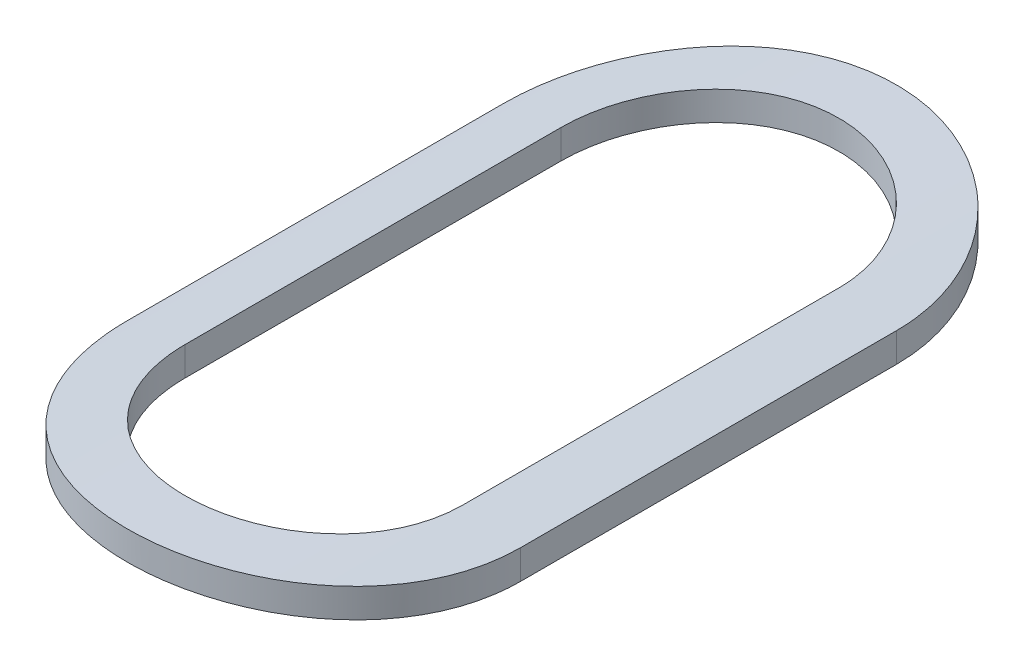
ISO-10303-21;
HEADER;
FILE_DESCRIPTION(('STEP AP214'),'2;1');
FILE_NAME('part.step','',(''),(''),'','','');
FILE_SCHEMA(('AUTOMOTIVE_DESIGN { 1 0 10303 214 1 1 1 1 }'));
ENDSEC;
DATA;
#1=APPLICATION_CONTEXT('core data for automotive mechanical design processes');
#2=APPLICATION_PROTOCOL_DEFINITION('international standard','automotive_design',2000,#1);
#3=PRODUCT_CONTEXT('',#1,'mechanical');
#4=PRODUCT('Part','Part','',(#3));
#5=PRODUCT_RELATED_PRODUCT_CATEGORY('part','',(#4));
#6=PRODUCT_DEFINITION_FORMATION('','',#4);
#7=PRODUCT_DEFINITION_CONTEXT('part definition',#1,'design');
#8=PRODUCT_DEFINITION('design','',#6,#7);
#9=PRODUCT_DEFINITION_SHAPE('','',#8);
#10=(LENGTH_UNIT() NAMED_UNIT(*) SI_UNIT(.MILLI.,.METRE.));
#11=(NAMED_UNIT(*) PLANE_ANGLE_UNIT() SI_UNIT($,.RADIAN.));
#12=(NAMED_UNIT(*) SI_UNIT($,.STERADIAN.) SOLID_ANGLE_UNIT());
#13=UNCERTAINTY_MEASURE_WITH_UNIT(LENGTH_MEASURE(1.E-05),#10,'distance_accuracy_value','');
#14=(GEOMETRIC_REPRESENTATION_CONTEXT(3) GLOBAL_UNCERTAINTY_ASSIGNED_CONTEXT((#13)) GLOBAL_UNIT_ASSIGNED_CONTEXT((#10,
#11,#12)) REPRESENTATION_CONTEXT('',''));
#15=CARTESIAN_POINT('',(0.,0.,0.));
#16=DIRECTION('',(0.,0.,1.));
#17=DIRECTION('',(1.,0.,0.));
#18=AXIS2_PLACEMENT_3D('',#15,#16,#17);
#19=CARTESIAN_POINT('',(-205.237767720161,-97.4477839792411,1.93657000024674));
#20=DIRECTION('',(0.,0.,1.));
#21=DIRECTION('',(1.,0.,0.));
#22=AXIS2_PLACEMENT_3D('',#19,#20,#21);
#23=CYLINDRICAL_SURFACE('',#22,5.00000000000003);
#24=CARTESIAN_POINT('',(-205.816025312001,-92.4813347287726,5.59072481894899));
#25=CARTESIAN_POINT('',(-205.81605345322,-92.4813470455981,5.55830863861098));
#26=CARTESIAN_POINT('',(-205.813301256707,-92.4810176953498,5.52590317346151));
#27=CARTESIAN_POINT('',(-205.802446677341,-92.4797671542148,5.46204489278413));
#28=CARTESIAN_POINT('',(-205.794349708049,-92.4788465622047,5.43059114696678));
#29=CARTESIAN_POINT('',(-205.773011592033,-92.4765042816047,5.36948772147703));
#30=CARTESIAN_POINT('',(-205.759768660538,-92.4750824191753,5.33983867185818));
#31=CARTESIAN_POINT('',(-205.728529674045,-92.4719021558279,5.28318577848136));
#32=CARTESIAN_POINT('',(-205.710534070537,-92.4701437868815,5.25618168379419));
#33=CARTESIAN_POINT('',(-205.670207756246,-92.4664783744416,5.20545632084834));
#34=CARTESIAN_POINT('',(-205.647859171863,-92.4645707380577,5.18174930304975));
#35=CARTESIAN_POINT('',(-205.599497501548,-92.460827112354,5.13841097931241));
#36=CARTESIAN_POINT('',(-205.573483858366,-92.4589911339836,5.11878029427919));
#37=CARTESIAN_POINT('',(-205.518441967116,-92.4555917582716,5.08410392899681));
#38=CARTESIAN_POINT('',(-205.489405485113,-92.4540291382538,5.06907123573406));
#39=CARTESIAN_POINT('',(-205.429200909222,-92.4513592357457,5.04410151892306));
#40=CARTESIAN_POINT('',(-205.398033010825,-92.4502519115612,5.03416402875613));
#41=CARTESIAN_POINT('',(-205.334596648131,-92.4486214638352,5.0197085814315));
#42=CARTESIAN_POINT('',(-205.302333729771,-92.4480957495245,5.01516658343613));
#43=CARTESIAN_POINT('',(-205.237498790808,-92.4476789168199,5.01155656965439));
#44=CARTESIAN_POINT('',(-205.204926773204,-92.4477877922755,5.01248850081497));
#45=CARTESIAN_POINT('',(-205.140563410856,-92.4486257894006,5.01978072308774));
#46=CARTESIAN_POINT('',(-205.108769075323,-92.4493519393145,5.02611500604303));
#47=CARTESIAN_POINT('',(-205.046697948224,-92.4513395212461,5.04399149063643));
#48=CARTESIAN_POINT('',(-205.016421173954,-92.4526009593627,5.05553375161367));
#49=CARTESIAN_POINT('',(-204.958162773233,-92.4555225006161,5.08352681484934));
#50=CARTESIAN_POINT('',(-204.930186698027,-92.4571835321094,5.0999890694036));
#51=CARTESIAN_POINT('',(-204.87738579882,-92.4607180906581,5.13734570534176));
#52=CARTESIAN_POINT('',(-204.852560962508,-92.4625916168832,5.15824006940841));
#53=CARTESIAN_POINT('',(-204.806616299284,-92.4663540775476,5.20401073591256));
#54=CARTESIAN_POINT('',(-204.785518493568,-92.4682430387985,5.22890914671363));
#55=CARTESIAN_POINT('',(-204.747792196947,-92.4718132541877,5.28191400103796));
#56=CARTESIAN_POINT('',(-204.731165046413,-92.473494445952,5.31002140307583));
#57=CARTESIAN_POINT('',(-204.702849827051,-92.4764596597479,5.36867354385038));
#58=CARTESIAN_POINT('',(-204.691166312109,-92.4777433152941,5.39922049915794));
#59=CARTESIAN_POINT('',(-204.67312304922,-92.479759834021,5.46182387993567));
#60=CARTESIAN_POINT('',(-204.666755270332,-92.4804935279044,5.4938779507941));
#61=CARTESIAN_POINT('',(-204.660710580302,-92.4811955947182,5.54764353747746));
#62=CARTESIAN_POINT('',(-204.659499727931,-92.4813388156744,5.56918928601582));
#63=CARTESIAN_POINT('',(-204.659510128705,-92.4813347287279,5.59072481894899));
#64=B_SPLINE_CURVE_WITH_KNOTS('',3,(#24,#25,#26,#27,#28,#29,#30,#31,#32,#33,#34,#35,#36,#37,#38,
#39,#40,#41,#42,#43,#44,#45,#46,#47,#48,#49,#50,#51,#52,#53,#54,#55,#56,#57,#58,#59,#60,#61,#62,
#63),.UNSPECIFIED.,.F.,.F.,(4,2,2,2,2,2,2,2,2,2,2,2,2,2,2,2,2,2,2,4),(0.,0.0971144596016317,
0.194130705508772,0.291180629617419,0.388221337577798,0.485669235955006,0.58313196669033,
0.680867490696586,0.778594062484605,0.87588353827593,0.973172071143981,1.0699948615776,
1.16681875522746,1.26386980537719,1.36092047633352,1.45852667401611,1.55616210298787,
1.65388727516014,1.75146453691093,1.81606442695371),.UNSPECIFIED.);
#65=CARTESIAN_POINT('',(-205.816025312001,-92.4813347287725,5.59072481894899));
#66=VERTEX_POINT('',#65);
#67=CARTESIAN_POINT('',(-204.659510128705,-92.4813347287279,5.59072481894899));
#68=VERTEX_POINT('',#67);
#69=EDGE_CURVE('E173',#66,#68,#64,.T.);
#70=ORIENTED_EDGE('',*,*,#69,.T.);
#71=DIRECTION('',(0.,0.,1.));
#72=VECTOR('',#71,1.);
#73=CARTESIAN_POINT('',(-204.659510128705,-92.4813347287279,5.59072481894899));
#74=LINE('',#73,#72);
#75=CARTESIAN_POINT('',(-204.659510128705,-92.4813347287279,7.15573389731877));
#76=VERTEX_POINT('',#75);
#77=EDGE_CURVE('E111',#76,#68,#74,.F.);
#78=ORIENTED_EDGE('',*,*,#77,.F.);
#79=CARTESIAN_POINT('',(-204.659510128705,-92.4813347287279,7.15573389731877));
#80=CARTESIAN_POINT('',(-204.65948198318,-92.4813470453749,7.18814998051298));
#81=CARTESIAN_POINT('',(-204.66223416535,-92.4810176971892,7.22055534875823));
#82=CARTESIAN_POINT('',(-204.673088717127,-92.4797671597198,7.28441363488721));
#83=CARTESIAN_POINT('',(-204.681185705116,-92.4788465657793,7.31586747756815));
#84=CARTESIAN_POINT('',(-204.702524070631,-92.4765042566045,7.376971643256));
#85=CARTESIAN_POINT('',(-204.715767326654,-92.4750823584012,7.40662130312217));
#86=CARTESIAN_POINT('',(-204.747006549714,-92.4719020810574,7.4632740903792));
#87=CARTESIAN_POINT('',(-204.765001863621,-92.4701437481661,7.49027758076557));
#88=CARTESIAN_POINT('',(-204.805325364428,-92.4664785790867,7.54099954981871));
#89=CARTESIAN_POINT('',(-204.827671036202,-92.4645711628689,7.56470408707736));
#90=CARTESIAN_POINT('',(-204.876032349208,-92.4608275253215,7.60804336459656));
#91=CARTESIAN_POINT('',(-204.902049364491,-92.4589913309773,7.62767657428111));
#92=CARTESIAN_POINT('',(-204.957107529511,-92.4555908299197,7.66236409441228));
#93=CARTESIAN_POINT('',(-204.986158174165,-92.4540274204009,7.67740341282563));
#94=CARTESIAN_POINT('',(-205.046371666948,-92.4513580548523,7.70236837040192));
#95=CARTESIAN_POINT('',(-205.077531998354,-92.4502515645608,7.712299985203));
#96=CARTESIAN_POINT('',(-205.130346152671,-92.4488934431359,7.72433731075692));
#97=CARTESIAN_POINT('',(-205.151664012772,-92.4484793797971,7.72795250716278));
#98=CARTESIAN_POINT('',(-205.194574057236,-92.4479245041211,7.73278007816721));
#99=CARTESIAN_POINT('',(-205.216166245618,-92.4477836957932,7.73399241750974));
#100=CARTESIAN_POINT('',(-205.270132833281,-92.4477844039261,7.73399009774741));
#101=CARTESIAN_POINT('',(-205.302518792684,-92.448101558574,7.73126510134122));
#102=CARTESIAN_POINT('',(-205.36639046982,-92.449336246177,7.72043685244457));
#103=CARTESIAN_POINT('',(-205.397875198236,-92.4502544143552,7.71232790942491));
#104=CARTESIAN_POINT('',(-205.459010687186,-92.4525875978119,7.69097284333577));
#105=CARTESIAN_POINT('',(-205.488662624789,-92.4540022902267,7.67773005795223));
#106=CARTESIAN_POINT('',(-205.545317635545,-92.4571708752444,7.64648980535055));
#107=CARTESIAN_POINT('',(-205.572321144898,-92.4589247118479,7.62849312291705));
#108=CARTESIAN_POINT('',(-205.623045523049,-92.4625847434808,7.58816547581902));
#109=CARTESIAN_POINT('',(-205.646752120136,-92.4644915478026,7.56581661476488));
#110=CARTESIAN_POINT('',(-205.690087991771,-92.4682377457699,7.51745532118685));
#111=CARTESIAN_POINT('',(-205.709716908808,-92.4700771334931,7.49144256776678));
#112=CARTESIAN_POINT('',(-205.744395340358,-92.4734866329095,7.43639752630437));
#113=CARTESIAN_POINT('',(-205.759430426865,-92.4750558895899,7.40735610141012));
#114=CARTESIAN_POINT('',(-205.784398136002,-92.4777383200303,7.34714349325492));
#115=CARTESIAN_POINT('',(-205.794333600315,-92.4788517477236,7.31597350709657));
#116=CARTESIAN_POINT('',(-205.806375173798,-92.4802182866102,7.26313576380745));
#117=CARTESIAN_POINT('',(-205.809991257807,-92.4806348583557,7.24180410654383));
#118=CARTESIAN_POINT('',(-205.81481628588,-92.4811939415349,7.19889604255411));
#119=CARTESIAN_POINT('',(-205.816028473882,-92.4813368222921,7.17732000522887));
#120=CARTESIAN_POINT('',(-205.816025312001,-92.4813347287726,7.15573389731877));
#121=B_SPLINE_CURVE_WITH_KNOTS('',3,(#79,#80,#81,#82,#83,#84,#85,#86,#87,#88,#89,#90,#91,#92,
#93,#94,#95,#96,#97,#98,#99,#100,#101,#102,#103,#104,#105,#106,#107,#108,#109,#110,#111,#112,
#113,#114,#115,#116,#117,#118,#119,#120),.UNSPECIFIED.,.F.,.F.,(4,2,2,2,2,2,2,2,2,2,2,2,2,2,2,2,
2,2,2,2,4),(0.,0.0971141698559982,0.194130705514868,0.291182687565261,0.388221337553569,
0.485658369900073,0.583131966607676,0.680920348294414,0.778594063001648,0.843344867671633,
0.908096622394172,1.00511304740935,1.10223217692015,1.19928827157682,1.29632835398478,
1.3937762336066,1.49123265335904,1.5889920840456,1.68669698057032,1.75148885975864,
1.81619324588166),.UNSPECIFIED.);
#122=CARTESIAN_POINT('',(-205.816025312001,-92.4813347287725,7.15573389731877));
#123=VERTEX_POINT('',#122);
#124=EDGE_CURVE('E118',#76,#123,#121,.T.);
#125=ORIENTED_EDGE('',*,*,#124,.T.);
#126=DIRECTION('',(0.,0.,-1.));
#127=VECTOR('',#126,1.);
#128=CARTESIAN_POINT('',(-205.816025312001,-92.4813347287725,7.15573389731877));
#129=LINE('',#128,#127);
#130=EDGE_CURVE('E115',#66,#123,#129,.F.);
#131=ORIENTED_EDGE('',*,*,#130,.F.);
#132=EDGE_LOOP('',(#70,#78,#125,#131));
#133=FACE_BOUND('',#132,.T.);
#134=DIRECTION('',(0.,0.,1.));
#135=VECTOR('',#134,1.);
#136=CARTESIAN_POINT('',(-206.056025312001,-92.5151929244914,5.5907247421057));
#137=LINE('',#136,#135);
#138=CARTESIAN_POINT('',(-206.056025312001,-92.5151929244914,7.15573404952093));
#139=VERTEX_POINT('',#138);
#140=CARTESIAN_POINT('',(-206.056025312001,-92.5151929244914,5.59072479973817));
#141=VERTEX_POINT('',#140);
#142=EDGE_CURVE('E98',#139,#141,#137,.F.);
#143=ORIENTED_EDGE('',*,*,#142,.F.);
#144=CARTESIAN_POINT('',(-204.419510128705,-92.5151929244278,7.15573393574041));
#145=CARTESIAN_POINT('',(-204.419469583894,-92.5152177455033,7.20144062728406));
#146=CARTESIAN_POINT('',(-204.423337202401,-92.514558298794,7.24712861852095));
#147=CARTESIAN_POINT('',(-204.438581215502,-92.5120563218705,7.33714331646355));
#148=CARTESIAN_POINT('',(-204.449947946265,-92.5102153143735,7.38147169841267));
#149=CARTESIAN_POINT('',(-204.479887760545,-92.505534208199,7.46757797875938));
#150=CARTESIAN_POINT('',(-204.498462619333,-92.5026938634135,7.50935524591362));
#151=CARTESIAN_POINT('',(-204.542264858439,-92.496343081097,7.58920088857968));
#152=CARTESIAN_POINT('',(-204.567492006978,-92.4928326669135,7.62726939324835));
#153=CARTESIAN_POINT('',(-204.624135409762,-92.4854987717767,7.69897043503352));
#154=CARTESIAN_POINT('',(-204.65560135479,-92.481672931592,7.73256347916432));
#155=CARTESIAN_POINT('',(-204.723733811126,-92.4741593685713,7.7940285489356));
#156=CARTESIAN_POINT('',(-204.760402239161,-92.4704716972759,7.82189845672336));
#157=CARTESIAN_POINT('',(-204.838163315761,-92.4636242885595,7.87127330484976));
#158=CARTESIAN_POINT('',(-204.87928180731,-92.4604679404276,7.8927380112084));
#159=CARTESIAN_POINT('',(-204.964570477406,-92.4550711398516,7.92841794469071));
#160=CARTESIAN_POINT('',(-205.008736994849,-92.4528296102206,7.94264170284925));
#161=CARTESIAN_POINT('',(-205.083910694341,-92.4500602914303,7.95999259391576));
#162=CARTESIAN_POINT('',(-205.114434780676,-92.4492108397193,7.96523433098877));
#163=CARTESIAN_POINT('',(-205.175890775964,-92.4480724009212,7.97223446118956));
#164=CARTESIAN_POINT('',(-205.206822688049,-92.4477834181408,7.97399282755124));
#165=CARTESIAN_POINT('',(-205.283398607863,-92.4477848066276,7.97398951511892));
#166=CARTESIAN_POINT('',(-205.329058023749,-92.448415213171,7.97016126957229));
#167=CARTESIAN_POINT('',(-205.419099966746,-92.450869588219,7.95495422428733));
#168=CARTESIAN_POINT('',(-205.463481130311,-92.4526947853451,7.94356765203653));
#169=CARTESIAN_POINT('',(-205.549646007249,-92.4573338703443,7.91359646311223));
#170=CARTESIAN_POINT('',(-205.591431903344,-92.4601469137761,7.89501799290937));
#171=CARTESIAN_POINT('',(-205.671287461548,-92.4664521176568,7.85120532604741));
#172=CARTESIAN_POINT('',(-205.709357582195,-92.4699441941514,7.82597195205024));
#173=CARTESIAN_POINT('',(-205.781057576196,-92.4772560952725,7.76931874459996));
#174=CARTESIAN_POINT('',(-205.814648260083,-92.481078384344,7.73784962869663));
#175=CARTESIAN_POINT('',(-205.876098923618,-92.4886011796767,7.66972142970277));
#176=CARTESIAN_POINT('',(-205.903958316683,-92.4923016734399,7.63306181602657));
#177=CARTESIAN_POINT('',(-205.953315865383,-92.4991864135317,7.55532107308957));
#178=CARTESIAN_POINT('',(-205.974773689082,-92.5023673318523,7.51421404533556));
#179=CARTESIAN_POINT('',(-206.010454954267,-92.5078161409318,7.42892485239091));
#180=CARTESIAN_POINT('',(-206.024682761172,-92.510084582463,7.38474456117462));
#181=CARTESIAN_POINT('',(-206.042035603347,-92.5128875242913,7.30954355458309));
#182=CARTESIAN_POINT('',(-206.047276741209,-92.5137474123375,7.27900648206287));
#183=CARTESIAN_POINT('',(-206.054272095082,-92.5149020576824,7.21756231142058));
#184=CARTESIAN_POINT('',(-206.056030475274,-92.5151974898613,7.18665569969813));
#185=CARTESIAN_POINT('',(-206.056025312001,-92.5151929244915,7.15573404952093));
#186=B_SPLINE_CURVE_WITH_KNOTS('',3,(#144,#145,#146,#147,#148,#149,#150,#151,#152,#153,#154,
#155,#156,#157,#158,#159,#160,#161,#162,#163,#164,#165,#166,#167,#168,#169,#170,#171,#172,#173,
#174,#175,#176,#177,#178,#179,#180,#181,#182,#183,#184,#185),.UNSPECIFIED.,.F.,.F.,(4,2,2,2,2,2,
2,2,2,2,2,2,2,2,2,2,2,2,2,2,4),(0.,0.136923950960331,0.273671796791194,0.410453343293104,
0.547230124703325,0.685143554436099,0.823107927577552,0.96192150806652,1.10057116248184,
1.19332857538334,1.28608670102634,1.42286586335768,1.55978589921435,1.69658917540754,
1.83337554825507,1.97128949854094,2.10921755692805,2.24799709478118,2.38669273896364,
2.47948852703616,2.57217329610049),.UNSPECIFIED.);
#187=CARTESIAN_POINT('',(-204.419510128705,-92.5151929244278,7.15573391652959));
#188=VERTEX_POINT('',#187);
#189=EDGE_CURVE('E21',#188,#139,#186,.T.);
#190=ORIENTED_EDGE('',*,*,#189,.F.);
#191=DIRECTION('',(0.,0.,-1.));
#192=VECTOR('',#191,1.);
#193=CARTESIAN_POINT('',(-204.419510128705,-92.5151929244278,7.15573397416205));
#194=LINE('',#193,#192);
#195=CARTESIAN_POINT('',(-204.419510128705,-92.5151929244278,5.59072463315072));
#196=VERTEX_POINT('',#195);
#197=EDGE_CURVE('E85',#196,#188,#194,.F.);
#198=ORIENTED_EDGE('',*,*,#197,.F.);
#199=CARTESIAN_POINT('',(-206.056025312001,-92.5151929244915,5.59072478052735));
#200=CARTESIAN_POINT('',(-206.056065850808,-92.515217745583,5.54501798086097));
#201=CARTESIAN_POINT('',(-206.052198216996,-92.5145582957453,5.49932988171258));
#202=CARTESIAN_POINT('',(-206.036954174544,-92.5120563133006,5.40931518981686));
#203=CARTESIAN_POINT('',(-206.025587465142,-92.5102153089893,5.36498691568371));
#204=CARTESIAN_POINT('',(-205.995647976741,-92.505534255493,5.27888160837736));
#205=CARTESIAN_POINT('',(-205.977073551117,-92.502693978035,5.23710516070275));
#206=CARTESIAN_POINT('',(-205.933271629356,-92.4963432223219,5.15725937641797));
#207=CARTESIAN_POINT('',(-205.908044096061,-92.4928327403238,5.11919006051434));
#208=CARTESIAN_POINT('',(-205.851396862148,-92.485498374046,5.04748437182457));
#209=CARTESIAN_POINT('',(-205.819926933647,-92.4816721051632,5.01388791642143));
#210=CARTESIAN_POINT('',(-205.751793995122,-92.4741585643196,4.95242414862027));
#211=CARTESIAN_POINT('',(-205.715130190961,-92.4704713137239,4.92455771393512));
#212=CARTESIAN_POINT('',(-205.637391631918,-92.463626125481,4.87519843513922));
#213=CARTESIAN_POINT('',(-205.596292805583,-92.4604713419292,4.85374302744877));
#214=CARTESIAN_POINT('',(-205.511016664348,-92.4550734914938,4.81805647838143));
#215=CARTESIAN_POINT('',(-205.466839718733,-92.4528303154637,4.80382447209881));
#216=CARTESIAN_POINT('',(-205.377075908382,-92.4495251357669,4.7831101446398));
#217=CARTESIAN_POINT('',(-205.331505067711,-92.4484528095476,4.77656005871528));
#218=CARTESIAN_POINT('',(-205.239898318281,-92.4475746926404,4.77118480712422));
#219=CARTESIAN_POINT('',(-205.193862429081,-92.4477688489088,4.7723593179304));
#220=CARTESIAN_POINT('',(-205.103097894796,-92.4493936818346,4.78234723644037));
#221=CARTESIAN_POINT('',(-205.058360960137,-92.4508125204654,4.79108751421577));
#222=CARTESIAN_POINT('',(-204.970997657123,-92.4547140846072,4.81584372512715));
#223=CARTESIAN_POINT('',(-204.928371337958,-92.4571968349013,4.83185982774976));
#224=CARTESIAN_POINT('',(-204.84622004591,-92.4629674986844,4.87078643699166));
#225=CARTESIAN_POINT('',(-204.806709726253,-92.4662589478132,4.89372732231488));
#226=CARTESIAN_POINT('',(-204.732073401851,-92.4732809318163,4.94582923116358));
#227=CARTESIAN_POINT('',(-204.696947574812,-92.4770114844759,4.97499050667523));
#228=CARTESIAN_POINT('',(-204.631648055881,-92.484547753114,5.03910687284073));
#229=CARTESIAN_POINT('',(-204.60153640729,-92.4883538392547,5.07412513420221));
#230=CARTESIAN_POINT('',(-204.547597917773,-92.4955714661168,5.1487620250887));
#231=CARTESIAN_POINT('',(-204.523772874036,-92.4989828938587,5.18838196547077));
#232=CARTESIAN_POINT('',(-204.483072318769,-92.5050255837505,5.27117369756667));
#233=CARTESIAN_POINT('',(-204.46620814016,-92.5076555717108,5.3143511452217));
#234=CARTESIAN_POINT('',(-204.440013102122,-92.5118173602202,5.40294883090291));
#235=CARTESIAN_POINT('',(-204.430670974507,-92.5133508030295,5.44836560564371));
#236=CARTESIAN_POINT('',(-204.4233185101,-92.5145624854378,5.51022600836041));
#237=CARTESIAN_POINT('',(-204.421889767019,-92.5147986920222,5.52630589035521));
#238=CARTESIAN_POINT('',(-204.419986824293,-92.5151137500438,5.55849638745254));
#239=CARTESIAN_POINT('',(-204.419511019327,-92.515192866114,5.57460690502848));
#240=CARTESIAN_POINT('',(-204.419510128705,-92.5151929244277,5.59072463315072));
#241=B_SPLINE_CURVE_WITH_KNOTS('',3,(#199,#200,#201,#202,#203,#204,#205,#206,#207,#208,#209,
#210,#211,#212,#213,#214,#215,#216,#217,#218,#219,#220,#221,#222,#223,#224,#225,#226,#227,#228,
#229,#230,#231,#232,#233,#234,#235,#236,#237,#238,#239,#240),.UNSPECIFIED.,.F.,.F.,(4,2,2,2,2,2,
2,2,2,2,2,2,2,2,2,2,2,2,2,2,4),(0.,0.136924273568553,0.273671796779466,0.410450578793854,
0.547230124755246,0.685158470322033,0.823107927758298,0.961847852289611,1.10057116064877,
1.23806131441292,1.37554570974907,1.5117158488138,1.64788916005503,1.78466876048583,
1.92145390287004,2.05982271657086,2.19823104382085,2.33686383193083,2.47528855687437,
2.52370175778949,2.57203333292965),.UNSPECIFIED.);
#242=EDGE_CURVE('E99',#141,#196,#241,.T.);
#243=ORIENTED_EDGE('',*,*,#242,.F.);
#244=EDGE_LOOP('',(#143,#190,#198,#243));
#245=FACE_BOUND('',#244,.T.);
#246=ADVANCED_FACE('F17',(#133,#245),#23,.T.);
#247=CARTESIAN_POINT('',(-206.056025312001,-90.5682667595488,5.5907247421057));
#248=DIRECTION('',(-1.,0.,0.));
#249=DIRECTION('',(0.,0.,1.));
#250=AXIS2_PLACEMENT_3D('',#247,#248,#249);
#251=PLANE('',#250);
#252=ORIENTED_EDGE('',*,*,#142,.T.);
#253=DIRECTION('',(0.,1.,0.));
#254=VECTOR('',#253,1.);
#255=CARTESIAN_POINT('',(-206.056025312001,-90.5682667595488,5.59072478052734));
#256=LINE('',#255,#254);
#257=CARTESIAN_POINT('',(-206.056025312001,-92.6368740327345,5.59072479973817));
#258=VERTEX_POINT('',#257);
#259=EDGE_CURVE('E168',#258,#141,#256,.T.);
#260=ORIENTED_EDGE('',*,*,#259,.F.);
#261=DIRECTION('',(0.,0.,1.));
#262=VECTOR('',#261,1.);
#263=CARTESIAN_POINT('',(-206.056025312001,-92.6368740327345,1.93657000024674));
#264=LINE('',#263,#262);
#265=CARTESIAN_POINT('',(-206.056025312001,-92.6368740327345,7.15573404952093));
#266=VERTEX_POINT('',#265);
#267=EDGE_CURVE('E106',#258,#266,#264,.T.);
#268=ORIENTED_EDGE('',*,*,#267,.T.);
#269=DIRECTION('',(0.,1.,0.));
#270=VECTOR('',#269,1.);
#271=CARTESIAN_POINT('',(-206.056025312001,-90.5682667595488,7.15573404952093));
#272=LINE('',#271,#270);
#273=EDGE_CURVE('E93',#139,#266,#272,.F.);
#274=ORIENTED_EDGE('',*,*,#273,.F.);
#275=EDGE_LOOP('',(#252,#260,#268,#274));
#276=FACE_BOUND('',#275,.T.);
#277=ADVANCED_FACE('F105',(#276),#251,.T.);
#278=CARTESIAN_POINT('',(-205.237767720353,-90.5682667595488,7.15573389731877));
#279=DIRECTION('',(0.,1.,0.));
#280=DIRECTION('',(0.,0.,1.));
#281=AXIS2_PLACEMENT_3D('',#278,#279,#280);
#282=CYLINDRICAL_SURFACE('',#281,0.818257591648157);
#283=DIRECTION('',(0.,1.,0.));
#284=VECTOR('',#283,1.);
#285=CARTESIAN_POINT('',(-204.419510128705,-90.5682667595488,7.15573393574041));
#286=LINE('',#285,#284);
#287=CARTESIAN_POINT('',(-204.419510128705,-92.6368740326692,7.15573391652959));
#288=VERTEX_POINT('',#287);
#289=EDGE_CURVE('E95',#188,#288,#286,.F.);
#290=ORIENTED_EDGE('',*,*,#289,.F.);
#291=ORIENTED_EDGE('',*,*,#189,.T.);
#292=ORIENTED_EDGE('',*,*,#273,.T.);
#293=CARTESIAN_POINT('',(-206.056025312001,-92.6368740327345,7.15573404952093));
#294=CARTESIAN_POINT('',(-206.056065921352,-92.6368994793883,7.20142445889431));
#295=CARTESIAN_POINT('',(-206.052200966113,-92.6362238161791,7.24709581319684));
#296=CARTESIAN_POINT('',(-206.036968439681,-92.6336605145276,7.3370758927431));
#297=CARTESIAN_POINT('',(-206.025610733758,-92.6317744698129,7.38138632965162));
#298=CARTESIAN_POINT('',(-205.995696237809,-92.6269791620225,7.46745686640818));
#299=CARTESIAN_POINT('',(-205.977137759895,-92.6240696590593,7.50921636564857));
#300=CARTESIAN_POINT('',(-205.933375508098,-92.6175644569927,7.58903003851365));
#301=CARTESIAN_POINT('',(-205.908171898375,-92.613968774841,7.62708430363948));
#302=CARTESIAN_POINT('',(-205.851569911574,-92.6064550500433,7.69877794601749));
#303=CARTESIAN_POINT('',(-205.820119377924,-92.6025344673586,7.73237588363824));
#304=CARTESIAN_POINT('',(-205.752017050511,-92.5948343659367,7.79385452933834));
#305=CARTESIAN_POINT('',(-205.715363342521,-92.5910548997649,7.82173312402348));
#306=CARTESIAN_POINT('',(-205.637617200762,-92.5840351827162,7.87113690487236));
#307=CARTESIAN_POINT('',(-205.59649765922,-92.5807985674395,7.89261994686493));
#308=CARTESIAN_POINT('',(-205.511200595883,-92.5752637467863,7.92833522100554));
#309=CARTESIAN_POINT('',(-205.467026745235,-92.5729644369773,7.94257599169339));
#310=CARTESIAN_POINT('',(-205.39180925086,-92.5701219000218,7.95995868886599));
#311=CARTESIAN_POINT('',(-205.361249460828,-92.569249467263,7.96521307832648));
#312=CARTESIAN_POINT('',(-205.299720061526,-92.5680802177776,7.97223016093575));
#313=CARTESIAN_POINT('',(-205.26875044941,-92.5677834050525,7.97399282981159));
#314=CARTESIAN_POINT('',(-205.192153355237,-92.567784824591,7.97398951490654));
#315=CARTESIAN_POINT('',(-205.146510558836,-92.5684302632369,7.97016400730152));
#316=CARTESIAN_POINT('',(-205.056502147742,-92.5709431824667,7.95496834703232));
#317=CARTESIAN_POINT('',(-205.012137892963,-92.5728119175024,7.94359044946237));
#318=CARTESIAN_POINT('',(-204.926007053466,-92.5775617659709,7.91364362909559));
#319=CARTESIAN_POINT('',(-204.88423823572,-92.580441994546,7.89508099008717));
#320=CARTESIAN_POINT('',(-204.804413714789,-92.5868982541706,7.8513071221693));
#321=CARTESIAN_POINT('',(-204.766357568201,-92.5904742019774,7.82609668853926));
#322=CARTESIAN_POINT('',(-204.694665515389,-92.5979641700168,7.7694843316278));
#323=CARTESIAN_POINT('',(-204.661070638303,-92.6018808441097,7.73803079878828));
#324=CARTESIAN_POINT('',(-204.59960769215,-92.609590759877,7.66993330081925));
#325=CARTESIAN_POINT('',(-204.571740218754,-92.6133839886781,7.63328879647803));
#326=CARTESIAN_POINT('',(-204.522354353636,-92.6204438996072,7.55556327437977));
#327=CARTESIAN_POINT('',(-204.500878322293,-92.6237070063014,7.51445501830231));
#328=CARTESIAN_POINT('',(-204.465162052465,-92.6292977740442,7.42915721751077));
#329=CARTESIAN_POINT('',(-204.450917412383,-92.6316260039523,7.38496956583603));
#330=CARTESIAN_POINT('',(-204.433533272905,-92.6345047311212,7.30972546597324));
#331=CARTESIAN_POINT('',(-204.428279714226,-92.6353884213789,7.27915346398208));
#332=CARTESIAN_POINT('',(-204.421267581236,-92.636575088953,7.21763700566062));
#333=CARTESIAN_POINT('',(-204.41950488892,-92.6368787504859,7.18669303155297));
#334=CARTESIAN_POINT('',(-204.419510128705,-92.6368740326692,7.15573393574041));
#335=B_SPLINE_CURVE_WITH_KNOTS('',3,(#293,#294,#295,#296,#297,#298,#299,#300,#301,#302,#303,
#304,#305,#306,#307,#308,#309,#310,#311,#312,#313,#314,#315,#316,#317,#318,#319,#320,#321,#322,
#323,#324,#325,#326,#327,#328,#329,#330,#331,#332,#333,#334),.UNSPECIFIED.,.F.,.F.,(4,2,2,2,2,2,
2,2,2,2,2,2,2,2,2,2,2,2,2,2,4),(0.,0.136874463677233,0.273569071423,0.410295740272831,
0.547019031786763,0.684935848575094,0.82290353653539,0.961761216109301,1.10045480260566,
1.19332512698137,1.28619609694949,1.42292550916479,1.55979535319295,1.69654576010989,
1.83327981491468,1.97119518154854,2.10912488464851,2.24794936215897,2.38668923844877,
2.47959560857871,2.57239231615866),.UNSPECIFIED.);
#336=EDGE_CURVE('E150',#266,#288,#335,.T.);
#337=ORIENTED_EDGE('',*,*,#336,.T.);
#338=EDGE_LOOP('',(#290,#291,#292,#337));
#339=FACE_BOUND('',#338,.T.);
#340=ADVANCED_FACE('F91',(#339),#282,.T.);
#341=CARTESIAN_POINT('',(-204.419510128705,-90.5682667595488,7.15573397416205));
#342=DIRECTION('',(1.,0.,0.));
#343=DIRECTION('',(0.,0.,-1.));
#344=AXIS2_PLACEMENT_3D('',#341,#342,#343);
#345=PLANE('',#344);
#346=ORIENTED_EDGE('',*,*,#197,.T.);
#347=ORIENTED_EDGE('',*,*,#289,.T.);
#348=DIRECTION('',(0.,0.,1.));
#349=VECTOR('',#348,1.);
#350=CARTESIAN_POINT('',(-204.419510128705,-92.6368740326692,1.93657000024674));
#351=LINE('',#350,#349);
#352=CARTESIAN_POINT('',(-204.419510128705,-92.6368740326692,5.59072463315072));
#353=VERTEX_POINT('',#352);
#354=EDGE_CURVE('E149',#288,#353,#351,.F.);
#355=ORIENTED_EDGE('',*,*,#354,.T.);
#356=DIRECTION('',(0.,1.,0.));
#357=VECTOR('',#356,1.);
#358=CARTESIAN_POINT('',(-204.419510128705,-90.5682667595488,5.59072463315072));
#359=LINE('',#358,#357);
#360=EDGE_CURVE('E114',#196,#353,#359,.F.);
#361=ORIENTED_EDGE('',*,*,#360,.F.);
#362=EDGE_LOOP('',(#346,#347,#355,#361));
#363=FACE_BOUND('',#362,.T.);
#364=ADVANCED_FACE('F161',(#363),#345,.T.);
#365=CARTESIAN_POINT('',(-205.237767720353,-90.5682667595488,5.59072481894899));
#366=DIRECTION('',(0.,1.,0.));
#367=DIRECTION('',(0.,0.,1.));
#368=AXIS2_PLACEMENT_3D('',#365,#366,#367);
#369=CYLINDRICAL_SURFACE('',#368,0.818257591648161);
#370=ORIENTED_EDGE('',*,*,#360,.T.);
#371=CARTESIAN_POINT('',(-204.419510128705,-92.6368740326692,5.59072463315072));
#372=CARTESIAN_POINT('',(-204.419469527225,-92.6368994790153,5.54503411841966));
#373=CARTESIAN_POINT('',(-204.423334499175,-92.6362238123658,5.49936265912547));
#374=CARTESIAN_POINT('',(-204.438567057757,-92.6336605046037,5.40938258599279));
#375=CARTESIAN_POINT('',(-204.449924744654,-92.6317744627864,5.36507225450437));
#376=CARTESIAN_POINT('',(-204.479838920958,-92.6269792080743,5.27900268469982));
#377=CARTESIAN_POINT('',(-204.498396970002,-92.62406977352,5.23724400135419));
#378=CARTESIAN_POINT('',(-204.542158909519,-92.6175645982258,5.15743018944292));
#379=CARTESIAN_POINT('',(-204.567362903171,-92.6139688468309,5.11937511838941));
#380=CARTESIAN_POINT('',(-204.623968709372,-92.6064546407439,5.04767684680247));
#381=CARTESIAN_POINT('',(-204.65542321429,-92.6025336200587,5.01407550901422));
#382=CARTESIAN_POINT('',(-204.723526024272,-92.5948335412902,4.95259816333541));
#383=CARTESIAN_POINT('',(-204.760175124282,-92.5910545050476,4.92472303335046));
#384=CARTESIAN_POINT('',(-204.837898801738,-92.584037059949,4.87533480319546));
#385=CARTESIAN_POINT('',(-204.878998716773,-92.5808020462126,4.85386105366127));
#386=CARTESIAN_POINT('',(-204.964283262063,-92.5752661529562,4.81813917958076));
#387=CARTESIAN_POINT('',(-205.00846751354,-92.5729651589676,4.80389016955447));
#388=CARTESIAN_POINT('',(-205.098231495951,-92.5695745579261,4.78314991665668));
#389=CARTESIAN_POINT('',(-205.143794374454,-92.5684738560823,4.7765875800244));
#390=CARTESIAN_POINT('',(-205.235387982224,-92.5675697244729,4.7711858266756));
#391=CARTESIAN_POINT('',(-205.281418690319,-92.5677662362586,4.77234606200284));
#392=CARTESIAN_POINT('',(-205.37215278697,-92.5694256607581,4.78230139960951));
#393=CARTESIAN_POINT('',(-205.416864859033,-92.5708758478578,4.79101978428262));
#394=CARTESIAN_POINT('',(-205.504182029489,-92.5748654685862,4.8157230570864));
#395=CARTESIAN_POINT('',(-205.546787076565,-92.5774049287311,4.83170812211004));
#396=CARTESIAN_POINT('',(-205.62890970343,-92.5833094534524,4.87056739148629));
#397=CARTESIAN_POINT('',(-205.668412004834,-92.5866783022803,4.89347328554281));
#398=CARTESIAN_POINT('',(-205.743039629468,-92.5938672229189,4.94549997500367));
#399=CARTESIAN_POINT('',(-205.778164756255,-92.597687314966,4.97462104918107));
#400=CARTESIAN_POINT('',(-205.843491667654,-92.6054089823972,5.03867237364675));
#401=CARTESIAN_POINT('',(-205.873628400287,-92.6093109837776,5.07366894898331));
#402=CARTESIAN_POINT('',(-205.927621066643,-92.6167129150722,5.14826817432974));
#403=CARTESIAN_POINT('',(-205.951475211383,-92.6202127303033,5.18787213168575));
#404=CARTESIAN_POINT('',(-205.992238794717,-92.6264147834324,5.27064344546594));
#405=CARTESIAN_POINT('',(-206.009136267758,-92.6291156448943,5.31381678942588));
#406=CARTESIAN_POINT('',(-206.035397032701,-92.6333922732365,5.40241496615499));
#407=CARTESIAN_POINT('',(-206.044771587227,-92.6349697215878,5.44783632475102));
#408=CARTESIAN_POINT('',(-206.052175513482,-92.636220632103,5.50979047620343));
#409=CARTESIAN_POINT('',(-206.053619786999,-92.6364654369652,5.52595695358436));
#410=CARTESIAN_POINT('',(-206.055543430648,-92.6367919731673,5.55832152169781));
#411=CARTESIAN_POINT('',(-206.056024423464,-92.6368739787471,5.57451951317874));
#412=CARTESIAN_POINT('',(-206.056025312001,-92.6368740327345,5.59072478052734));
#413=B_SPLINE_CURVE_WITH_KNOTS('',3,(#371,#372,#373,#374,#375,#376,#377,#378,#379,#380,#381,
#382,#383,#384,#385,#386,#387,#388,#389,#390,#391,#392,#393,#394,#395,#396,#397,#398,#399,#400,
#401,#402,#403,#404,#405,#406,#407,#408,#409,#410,#411,#412),.UNSPECIFIED.,.F.,.F.,(4,2,2,2,2,2,
2,2,2,2,2,2,2,2,2,2,2,2,2,2,4),(0.,0.136874778041384,0.273569071770025,0.410292990760095,
0.54701903255041,0.68495071968349,0.822903537865669,0.96168767669374,1.10045480171818,
1.23792807863377,1.37539516145216,1.5114830335167,1.64757421854905,1.78429824461452,
1.92102840453134,2.05942097460008,2.19785290982674,2.33652196465284,2.47498302754966,
2.52365902880849,2.57225296417635),.UNSPECIFIED.);
#414=EDGE_CURVE('E142',#353,#258,#413,.T.);
#415=ORIENTED_EDGE('',*,*,#414,.T.);
#416=ORIENTED_EDGE('',*,*,#259,.T.);
#417=ORIENTED_EDGE('',*,*,#242,.T.);
#418=EDGE_LOOP('',(#370,#415,#416,#417));
#419=FACE_BOUND('',#418,.T.);
#420=ADVANCED_FACE('F155',(#419),#369,.T.);
#421=CARTESIAN_POINT('',(-204.659510128705,-90.5682667595488,5.59072481894899));
#422=DIRECTION('',(-1.,0.,0.));
#423=DIRECTION('',(0.,0.,1.));
#424=AXIS2_PLACEMENT_3D('',#421,#422,#423);
#425=PLANE('',#424);
#426=ORIENTED_EDGE('',*,*,#77,.T.);
#427=DIRECTION('',(0.,1.,0.));
#428=VECTOR('',#427,1.);
#429=CARTESIAN_POINT('',(-204.659510128705,-90.5682667595488,5.59072481894899));
#430=LINE('',#429,#428);
#431=CARTESIAN_POINT('',(-204.659510128705,-92.6021655297629,5.59072481894899));
#432=VERTEX_POINT('',#431);
#433=EDGE_CURVE('E211',#68,#432,#430,.F.);
#434=ORIENTED_EDGE('',*,*,#433,.T.);
#435=DIRECTION('',(0.,0.,1.));
#436=VECTOR('',#435,1.);
#437=CARTESIAN_POINT('',(-204.659510128705,-92.6021655297629,1.93657000024674));
#438=LINE('',#437,#436);
#439=CARTESIAN_POINT('',(-204.659510128705,-92.6021655297629,7.15573389731877));
#440=VERTEX_POINT('',#439);
#441=EDGE_CURVE('E148',#432,#440,#438,.T.);
#442=ORIENTED_EDGE('',*,*,#441,.T.);
#443=DIRECTION('',(0.,1.,0.));
#444=VECTOR('',#443,1.);
#445=CARTESIAN_POINT('',(-204.659510128705,-90.5682667595488,7.15573389731877));
#446=LINE('',#445,#444);
#447=EDGE_CURVE('E113',#440,#76,#446,.T.);
#448=ORIENTED_EDGE('',*,*,#447,.T.);
#449=EDGE_LOOP('',(#426,#434,#442,#448));
#450=FACE_BOUND('',#449,.T.);
#451=ADVANCED_FACE('F160',(#450),#425,.T.);
#452=CARTESIAN_POINT('',(-205.237767720353,-90.5682667595488,7.15573389731877));
#453=DIRECTION('',(0.,1.,0.));
#454=DIRECTION('',(0.,0.,1.));
#455=AXIS2_PLACEMENT_3D('',#452,#453,#454);
#456=CYLINDRICAL_SURFACE('',#455,0.578257591648153);
#457=CARTESIAN_POINT('',(-204.659510128705,-92.6021655297629,7.15573389731877));
#458=CARTESIAN_POINT('',(-204.659481957695,-92.602178153299,7.18814425723508));
#459=CARTESIAN_POINT('',(-204.662233198427,-92.601840707234,7.22054377871276));
#460=CARTESIAN_POINT('',(-204.673083692295,-92.6005594712664,7.28438989576059));
#461=CARTESIAN_POINT('',(-204.681177491197,-92.5996162997775,7.31583742901036));
#462=CARTESIAN_POINT('',(-204.702506907944,-92.5972166227029,7.37692903347968));
#463=CARTESIAN_POINT('',(-204.715744373165,-92.5957599327018,7.40657245231264));
#464=CARTESIAN_POINT('',(-204.746969457657,-92.5925018903091,7.46321402902586));
#465=CARTESIAN_POINT('',(-204.764956448485,-92.5907005835248,7.49021253622555));
#466=CARTESIAN_POINT('',(-204.805265366014,-92.5869454143583,7.54093201118528));
#467=CARTESIAN_POINT('',(-204.827605658019,-92.5849909274029,7.56463833790546));
#468=CARTESIAN_POINT('',(-204.87595648471,-92.581154785793,7.60798251886305));
#469=CARTESIAN_POINT('',(-204.901968392402,-92.5792731587216,7.62761884430487));
#470=CARTESIAN_POINT('',(-204.957021402263,-92.5757880639015,7.66231655332648));
#471=CARTESIAN_POINT('',(-204.986072425493,-92.5741855557436,7.67736228299945));
#472=CARTESIAN_POINT('',(-205.046288867268,-92.571449239681,7.70233959081321));
#473=CARTESIAN_POINT('',(-205.07745176562,-92.5703148841888,7.7122771472299));
#474=CARTESIAN_POINT('',(-205.130281320059,-92.5689221061355,7.724325549508));
#475=CARTESIAN_POINT('',(-205.151611741019,-92.568497347719,7.72794513583334));
#476=CARTESIAN_POINT('',(-205.194547583473,-92.5679281371298,7.73277858754603));
#477=CARTESIAN_POINT('',(-205.216153008906,-92.5677836889769,7.73399241843248));
#478=CARTESIAN_POINT('',(-205.270126942272,-92.5677844137934,7.73399009747103));
#479=CARTESIAN_POINT('',(-205.302506976806,-92.5681092485172,7.73126608074176));
#480=CARTESIAN_POINT('',(-205.366366696547,-92.5693738397822,7.7204419080818));
#481=CARTESIAN_POINT('',(-205.397845393709,-92.5703142460597,7.71233607150608));
#482=CARTESIAN_POINT('',(-205.45896873588,-92.5727039657535,7.69098974116767));
#483=CARTESIAN_POINT('',(-205.488614576455,-92.5741529432218,7.67775263637692));
#484=CARTESIAN_POINT('',(-205.545258536865,-92.5773984387854,7.64652630180806));
#485=CARTESIAN_POINT('',(-205.572257087131,-92.5791949002407,7.62853784632907));
#486=CARTESIAN_POINT('',(-205.62297884775,-92.5829445142876,7.58822470032403));
#487=CARTESIAN_POINT('',(-205.646687104412,-92.5848983223227,7.56588125542673));
#488=CARTESIAN_POINT('',(-205.69002764995,-92.5887372053421,7.51753055202029));
#489=CARTESIAN_POINT('',(-205.70965957881,-92.5906222742433,7.49152297023952));
#490=CARTESIAN_POINT('',(-205.7443480993,-92.5941170846556,7.43648311458825));
#491=CARTESIAN_POINT('',(-205.75938957871,-92.5957259093007,7.40744126391681));
#492=CARTESIAN_POINT('',(-205.784369575693,-92.5984762631943,7.34722566000531));
#493=CARTESIAN_POINT('',(-205.794310946446,-92.5996180536454,7.31605310983945));
#494=CARTESIAN_POINT('',(-205.806363492445,-92.6010198762788,7.26320013809191));
#495=CARTESIAN_POINT('',(-205.809983918514,-92.6014473399564,7.24185609777322));
#496=CARTESIAN_POINT('',(-205.814814805911,-92.6020210553505,7.19892245745967));
#497=CARTESIAN_POINT('',(-205.816028497349,-92.6021676839703,7.17733322575574));
#498=CARTESIAN_POINT('',(-205.816025312001,-92.6021655298087,7.15573389731877));
#499=B_SPLINE_CURVE_WITH_KNOTS('',3,(#457,#458,#459,#460,#461,#462,#463,#464,#465,#466,#467,
#468,#469,#470,#471,#472,#473,#474,#475,#476,#477,#478,#479,#480,#481,#482,#483,#484,#485,#486,
#487,#488,#489,#490,#491,#492,#493,#494,#495,#496,#497,#498),.UNSPECIFIED.,.F.,.F.,(4,2,2,2,2,2,
2,2,2,2,2,2,2,2,2,2,2,2,2,2,4),(0.,0.0970967769420499,0.194094580462134,0.291127253508,
0.388147093904097,0.485585457893891,0.583060356136446,0.680864021119702,0.778552960901515,
0.843343411859537,0.908134791969434,1.00513347976225,1.10223471520387,1.19927192861063,
1.29629333819088,1.393742180594,1.49119962589472,1.58897453339213,1.68669468236897,
1.75152566852681,1.81626958514255),.UNSPECIFIED.);
#500=CARTESIAN_POINT('',(-205.816025312001,-92.6021655298087,7.15573389731877));
#501=VERTEX_POINT('',#500);
#502=EDGE_CURVE('E125',#440,#501,#499,.T.);
#503=ORIENTED_EDGE('',*,*,#502,.T.);
#504=DIRECTION('',(0.,1.,0.));
#505=VECTOR('',#504,1.);
#506=CARTESIAN_POINT('',(-205.816025312001,-90.5682667595488,7.15573389731877));
#507=LINE('',#506,#505);
#508=EDGE_CURVE('E117',#123,#501,#507,.F.);
#509=ORIENTED_EDGE('',*,*,#508,.F.);
#510=ORIENTED_EDGE('',*,*,#124,.F.);
#511=ORIENTED_EDGE('',*,*,#447,.F.);
#512=EDGE_LOOP('',(#503,#509,#510,#511));
#513=FACE_BOUND('',#512,.T.);
#514=ADVANCED_FACE('F177',(#513),#456,.F.);
#515=CARTESIAN_POINT('',(-205.816025312001,-90.5682667595488,7.15573389731877));
#516=DIRECTION('',(1.,0.,0.));
#517=DIRECTION('',(0.,0.,-1.));
#518=AXIS2_PLACEMENT_3D('',#515,#516,#517);
#519=PLANE('',#518);
#520=ORIENTED_EDGE('',*,*,#130,.T.);
#521=ORIENTED_EDGE('',*,*,#508,.T.);
#522=DIRECTION('',(0.,0.,1.));
#523=VECTOR('',#522,1.);
#524=CARTESIAN_POINT('',(-205.816025312001,-92.6021655298087,1.93657000024674));
#525=LINE('',#524,#523);
#526=CARTESIAN_POINT('',(-205.816025312001,-92.6021655298087,5.59072481894899));
#527=VERTEX_POINT('',#526);
#528=EDGE_CURVE('E31',#501,#527,#525,.F.);
#529=ORIENTED_EDGE('',*,*,#528,.T.);
#530=DIRECTION('',(0.,1.,0.));
#531=VECTOR('',#530,1.);
#532=CARTESIAN_POINT('',(-205.816025312001,-90.5682667595488,5.59072481894899));
#533=LINE('',#532,#531);
#534=EDGE_CURVE('E39',#527,#66,#533,.T.);
#535=ORIENTED_EDGE('',*,*,#534,.T.);
#536=EDGE_LOOP('',(#520,#521,#529,#535));
#537=FACE_BOUND('',#536,.T.);
#538=ADVANCED_FACE('F180',(#537),#519,.T.);
#539=CARTESIAN_POINT('',(-205.237767720353,-90.5682667595488,5.59072481894899));
#540=DIRECTION('',(0.,1.,0.));
#541=DIRECTION('',(0.,0.,1.));
#542=AXIS2_PLACEMENT_3D('',#539,#540,#541);
#543=CYLINDRICAL_SURFACE('',#542,0.57825759164816);
#544=ORIENTED_EDGE('',*,*,#433,.F.);
#545=ORIENTED_EDGE('',*,*,#69,.F.);
#546=ORIENTED_EDGE('',*,*,#534,.F.);
#547=CARTESIAN_POINT('',(-205.816025312001,-92.6021655298087,5.59072481894899));
#548=CARTESIAN_POINT('',(-205.816053478707,-92.6021781535267,5.55831436294568));
#549=CARTESIAN_POINT('',(-205.813302223813,-92.6018407053704,5.52591474561703));
#550=CARTESIAN_POINT('',(-205.802451702707,-92.6005594656866,5.46206863396151));
#551=CARTESIAN_POINT('',(-205.794357922318,-92.599616296154,5.43062119652132));
#552=CARTESIAN_POINT('',(-205.773028754096,-92.5972166482552,5.36953032959066));
#553=CARTESIAN_POINT('',(-205.759791612471,-92.5957599948161,5.33988751943708));
#554=CARTESIAN_POINT('',(-205.728566763926,-92.5925019667271,5.28324583690917));
#555=CARTESIAN_POINT('',(-205.710579484392,-92.5907006230942,5.25624672697079));
#556=CARTESIAN_POINT('',(-205.670267758684,-92.5869452049801,5.20552386359442));
#557=CARTESIAN_POINT('',(-205.647924558929,-92.5849904927583,5.18181505979546));
#558=CARTESIAN_POINT('',(-205.599573375754,-92.5811543632473,5.13847183093746));
#559=CARTESIAN_POINT('',(-205.573564834966,-92.579272957161,5.11883802666493));
#560=CARTESIAN_POINT('',(-205.518528081065,-92.5757890145368,5.084151465089));
#561=CARTESIAN_POINT('',(-205.489491207454,-92.5741873148931,5.0691123580088));
#562=CARTESIAN_POINT('',(-205.429283679595,-92.571450449307,5.04413029506678));
#563=CARTESIAN_POINT('',(-205.398113224007,-92.5703152399981,5.03418686547363));
#564=CARTESIAN_POINT('',(-205.334676990304,-92.5686436759801,5.01972236334751));
#565=CARTESIAN_POINT('',(-205.302417040504,-92.568104535229,5.01517605707765));
#566=CARTESIAN_POINT('',(-205.237587076816,-92.5676763461855,5.01155666359265));
#567=CARTESIAN_POINT('',(-205.205017066436,-92.5677872905448,5.0124835145115));
#568=CARTESIAN_POINT('',(-205.14066485066,-92.568644533804,5.01976402737527));
#569=CARTESIAN_POINT('',(-205.108879509124,-92.5693876374769,5.02609039816395));
#570=CARTESIAN_POINT('',(-205.046825056601,-92.5714220865959,5.04394771351836));
#571=CARTESIAN_POINT('',(-205.016555963883,-92.5727134386462,5.05547872077913));
#572=CARTESIAN_POINT('',(-204.958307576872,-92.5757048001083,5.08344752444801));
#573=CARTESIAN_POINT('',(-204.930334088433,-92.5774058053153,5.09989730143417));
#574=CARTESIAN_POINT('',(-204.877535707264,-92.5810258910161,5.13722720407069));
#575=CARTESIAN_POINT('',(-204.852710809269,-92.5829449711451,5.15810732230985));
#576=CARTESIAN_POINT('',(-204.806755784325,-92.5868000571302,5.20385525413963));
#577=CARTESIAN_POINT('',(-204.785648781237,-92.5887360953593,5.22874629980599));
#578=CARTESIAN_POINT('',(-204.747902770911,-92.5923958859088,5.28173856788846));
#579=CARTESIAN_POINT('',(-204.731265100057,-92.594119574651,5.3098407469007));
#580=CARTESIAN_POINT('',(-204.702927581632,-92.5971604007343,5.36848601375497));
#581=CARTESIAN_POINT('',(-204.691232414404,-92.5984771524075,5.39903138279577));
#582=CARTESIAN_POINT('',(-204.673166128016,-92.6005463291249,5.4616345708422));
#583=CARTESIAN_POINT('',(-204.666786981662,-92.6012996048415,5.49369003198735));
#584=CARTESIAN_POINT('',(-204.660717529413,-92.6020220986081,5.5475191596715));
#585=CARTESIAN_POINT('',(-204.65949963408,-92.6021697551361,5.56912707876193));
#586=CARTESIAN_POINT('',(-204.659510128705,-92.6021655297629,5.59072481894899));
#587=B_SPLINE_CURVE_WITH_KNOTS('',3,(#547,#548,#549,#550,#551,#552,#553,#554,#555,#556,#557,
#558,#559,#560,#561,#562,#563,#564,#565,#566,#567,#568,#569,#570,#571,#572,#573,#574,#575,#576,
#577,#578,#579,#580,#581,#582,#583,#584,#585,#586),.UNSPECIFIED.,.F.,.F.,(4,2,2,2,2,2,2,2,2,2,2,
2,2,2,2,2,2,2,2,4),(0.,0.0970970635377746,0.194094580455858,0.291125200808226,0.388147093929412,
0.485596307795724,0.583060356221918,0.680811202924384,0.778552960346081,0.87583591277202,
0.973117765559295,1.0699108123392,1.16670502511896,1.26373694568999,1.36076870394471,
1.45838414810247,1.55602874807375,1.6537656073019,1.75135461501109,1.81614074530075),.UNSPECIFIED.);
#588=EDGE_CURVE('E11',#527,#432,#587,.T.);
#589=ORIENTED_EDGE('',*,*,#588,.T.);
#590=EDGE_LOOP('',(#544,#545,#546,#589));
#591=FACE_BOUND('',#590,.T.);
#592=ADVANCED_FACE('F131',(#591),#543,.F.);
#593=CARTESIAN_POINT('',(-205.237767720161,-97.4477839792411,1.93657000024674));
#594=DIRECTION('',(0.,0.,1.));
#595=DIRECTION('',(1.,0.,0.));
#596=AXIS2_PLACEMENT_3D('',#593,#594,#595);
#597=CYLINDRICAL_SURFACE('',#596,4.88000000000002);
#598=ORIENTED_EDGE('',*,*,#528,.F.);
#599=ORIENTED_EDGE('',*,*,#502,.F.);
#600=ORIENTED_EDGE('',*,*,#441,.F.);
#601=ORIENTED_EDGE('',*,*,#588,.F.);
#602=EDGE_LOOP('',(#598,#599,#600,#601));
#603=FACE_BOUND('',#602,.T.);
#604=ORIENTED_EDGE('',*,*,#354,.F.);
#605=ORIENTED_EDGE('',*,*,#336,.F.);
#606=ORIENTED_EDGE('',*,*,#267,.F.);
#607=ORIENTED_EDGE('',*,*,#414,.F.);
#608=EDGE_LOOP('',(#604,#605,#606,#607));
#609=FACE_BOUND('',#608,.T.);
#610=ADVANCED_FACE('F134',(#603,#609),#597,.F.);
#611=CLOSED_SHELL('',(#246,#277,#340,#364,#420,#451,#514,#538,#592,#610));
#612=MANIFOLD_SOLID_BREP('B1',#611);
#613=ADVANCED_BREP_SHAPE_REPRESENTATION('',(#18,#612),#14);
#614=SHAPE_DEFINITION_REPRESENTATION(#9,#613);
ENDSEC;
END-ISO-10303-21;
